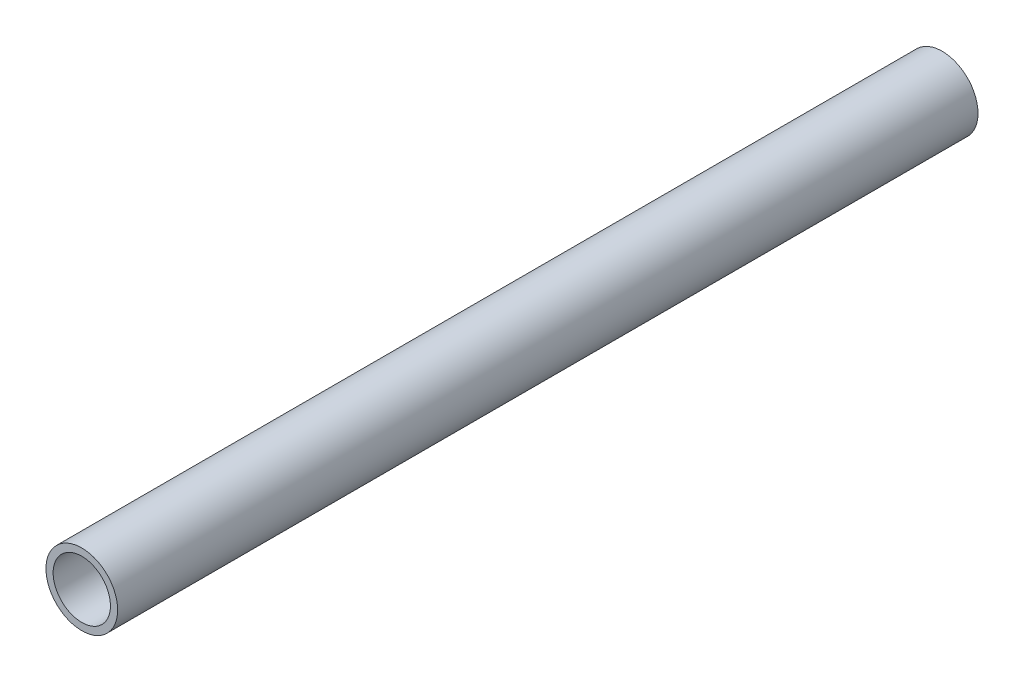
ISO-10303-21;
HEADER;
FILE_DESCRIPTION(('STEP AP214'),'2;1');
FILE_NAME('part.step','',(''),(''),'','','');
FILE_SCHEMA(('AUTOMOTIVE_DESIGN { 1 0 10303 214 1 1 1 1 }'));
ENDSEC;
DATA;
#1=APPLICATION_CONTEXT('core data for automotive mechanical design processes');
#2=APPLICATION_PROTOCOL_DEFINITION('international standard','automotive_design',2000,#1);
#3=PRODUCT_CONTEXT('',#1,'mechanical');
#4=PRODUCT('Part','Part','',(#3));
#5=PRODUCT_RELATED_PRODUCT_CATEGORY('part','',(#4));
#6=PRODUCT_DEFINITION_FORMATION('','',#4);
#7=PRODUCT_DEFINITION_CONTEXT('part definition',#1,'design');
#8=PRODUCT_DEFINITION('design','',#6,#7);
#9=PRODUCT_DEFINITION_SHAPE('','',#8);
#10=(LENGTH_UNIT() NAMED_UNIT(*) SI_UNIT(.MILLI.,.METRE.));
#11=(NAMED_UNIT(*) PLANE_ANGLE_UNIT() SI_UNIT($,.RADIAN.));
#12=(NAMED_UNIT(*) SI_UNIT($,.STERADIAN.) SOLID_ANGLE_UNIT());
#13=UNCERTAINTY_MEASURE_WITH_UNIT(LENGTH_MEASURE(1.E-05),#10,'distance_accuracy_value','');
#14=(GEOMETRIC_REPRESENTATION_CONTEXT(3) GLOBAL_UNCERTAINTY_ASSIGNED_CONTEXT((#13)) GLOBAL_UNIT_ASSIGNED_CONTEXT((#10,
#11,#12)) REPRESENTATION_CONTEXT('',''));
#15=CARTESIAN_POINT('',(0.,0.,0.));
#16=DIRECTION('',(0.,0.,1.));
#17=DIRECTION('',(1.,0.,0.));
#18=AXIS2_PLACEMENT_3D('',#15,#16,#17);
#19=CARTESIAN_POINT('',(0.,0.,30.));
#20=DIRECTION('',(0.,0.,-1.));
#21=DIRECTION('',(-1.,0.,0.));
#22=AXIS2_PLACEMENT_3D('',#19,#20,#21);
#23=CYLINDRICAL_SURFACE('',#22,1.25);
#24=CARTESIAN_POINT('',(0.,0.,30.));
#25=DIRECTION('',(0.,0.,1.));
#26=DIRECTION('',(1.,0.,0.));
#27=AXIS2_PLACEMENT_3D('',#24,#25,#26);
#28=CIRCLE('',#27,1.25);
#29=CARTESIAN_POINT('',(1.25,0.,30.));
#30=VERTEX_POINT('',#29);
#31=EDGE_CURVE('E10',#30,#30,#28,.T.);
#32=ORIENTED_EDGE('',*,*,#31,.F.);
#33=EDGE_LOOP('',(#32));
#34=FACE_BOUND('',#33,.T.);
#35=CARTESIAN_POINT('',(0.,0.,0.));
#36=DIRECTION('',(0.,0.,1.));
#37=DIRECTION('',(1.,0.,0.));
#38=AXIS2_PLACEMENT_3D('',#35,#36,#37);
#39=CIRCLE('',#38,1.25);
#40=CARTESIAN_POINT('',(1.25,0.,0.));
#41=VERTEX_POINT('',#40);
#42=EDGE_CURVE('E40',#41,#41,#39,.T.);
#43=ORIENTED_EDGE('',*,*,#42,.T.);
#44=EDGE_LOOP('',(#43));
#45=FACE_BOUND('',#44,.T.);
#46=ADVANCED_FACE('F37',(#34,#45),#23,.T.);
#47=CARTESIAN_POINT('',(0.,0.,30.));
#48=DIRECTION('',(0.,0.,1.));
#49=DIRECTION('',(1.,0.,0.));
#50=AXIS2_PLACEMENT_3D('',#47,#48,#49);
#51=PLANE('',#50);
#52=CARTESIAN_POINT('',(0.,0.,30.));
#53=DIRECTION('',(0.,0.,-1.));
#54=DIRECTION('',(-1.,0.,0.));
#55=AXIS2_PLACEMENT_3D('',#52,#53,#54);
#56=CIRCLE('',#55,1.);
#57=CARTESIAN_POINT('',(-1.,0.,30.));
#58=VERTEX_POINT('',#57);
#59=EDGE_CURVE('E47',#58,#58,#56,.T.);
#60=ORIENTED_EDGE('',*,*,#59,.T.);
#61=EDGE_LOOP('',(#60));
#62=FACE_BOUND('',#61,.T.);
#63=ORIENTED_EDGE('',*,*,#31,.T.);
#64=EDGE_LOOP('',(#63));
#65=FACE_BOUND('',#64,.T.);
#66=ADVANCED_FACE('F55',(#62,#65),#51,.T.);
#67=CARTESIAN_POINT('',(0.,0.,0.));
#68=DIRECTION('',(0.,0.,1.));
#69=DIRECTION('',(1.,0.,0.));
#70=AXIS2_PLACEMENT_3D('',#67,#68,#69);
#71=PLANE('',#70);
#72=CARTESIAN_POINT('',(0.,0.,0.));
#73=DIRECTION('',(0.,0.,-1.));
#74=DIRECTION('',(-1.,0.,0.));
#75=AXIS2_PLACEMENT_3D('',#72,#73,#74);
#76=CIRCLE('',#75,1.);
#77=CARTESIAN_POINT('',(-1.,0.,0.));
#78=VERTEX_POINT('',#77);
#79=EDGE_CURVE('E49',#78,#78,#76,.T.);
#80=ORIENTED_EDGE('',*,*,#79,.F.);
#81=EDGE_LOOP('',(#80));
#82=FACE_BOUND('',#81,.T.);
#83=ORIENTED_EDGE('',*,*,#42,.F.);
#84=EDGE_LOOP('',(#83));
#85=FACE_BOUND('',#84,.T.);
#86=ADVANCED_FACE('F60',(#82,#85),#71,.F.);
#87=CARTESIAN_POINT('',(0.,0.,30.));
#88=DIRECTION('',(0.,0.,-1.));
#89=DIRECTION('',(-1.,0.,0.));
#90=AXIS2_PLACEMENT_3D('',#87,#88,#89);
#91=CYLINDRICAL_SURFACE('',#90,1.);
#92=ORIENTED_EDGE('',*,*,#59,.F.);
#93=EDGE_LOOP('',(#92));
#94=FACE_BOUND('',#93,.T.);
#95=ORIENTED_EDGE('',*,*,#79,.T.);
#96=EDGE_LOOP('',(#95));
#97=FACE_BOUND('',#96,.T.);
#98=ADVANCED_FACE('F57',(#94,#97),#91,.F.);
#99=CLOSED_SHELL('',(#46,#66,#86,#98));
#100=MANIFOLD_SOLID_BREP('B2',#99);
#101=ADVANCED_BREP_SHAPE_REPRESENTATION('',(#18,#100),#14);
#102=SHAPE_DEFINITION_REPRESENTATION(#9,#101);
ENDSEC;
END-ISO-10303-21;
